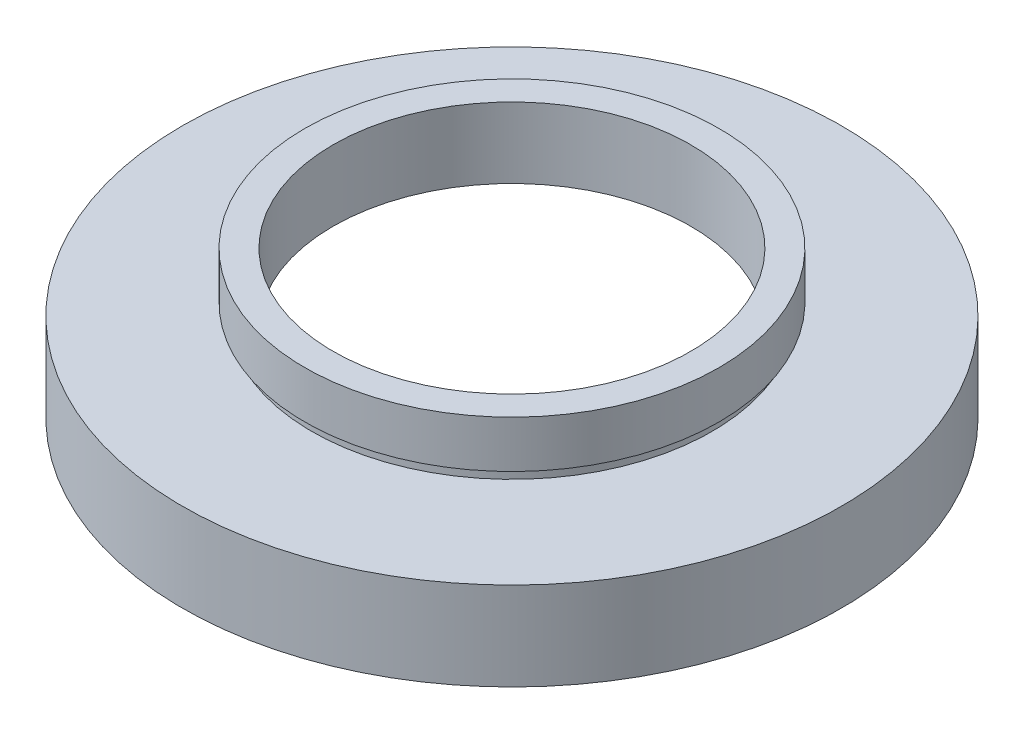
ISO-10303-21;
HEADER;
FILE_DESCRIPTION(('STEP AP214'),'2;1');
FILE_NAME('part.step','',(''),(''),'','','');
FILE_SCHEMA(('AUTOMOTIVE_DESIGN { 1 0 10303 214 1 1 1 1 }'));
ENDSEC;
DATA;
#1=APPLICATION_CONTEXT('core data for automotive mechanical design processes');
#2=APPLICATION_PROTOCOL_DEFINITION('international standard','automotive_design',2000,#1);
#3=PRODUCT_CONTEXT('',#1,'mechanical');
#4=PRODUCT('Part','Part','',(#3));
#5=PRODUCT_RELATED_PRODUCT_CATEGORY('part','',(#4));
#6=PRODUCT_DEFINITION_FORMATION('','',#4);
#7=PRODUCT_DEFINITION_CONTEXT('part definition',#1,'design');
#8=PRODUCT_DEFINITION('design','',#6,#7);
#9=PRODUCT_DEFINITION_SHAPE('','',#8);
#10=(LENGTH_UNIT() NAMED_UNIT(*) SI_UNIT(.MILLI.,.METRE.));
#11=(NAMED_UNIT(*) PLANE_ANGLE_UNIT() SI_UNIT($,.RADIAN.));
#12=(NAMED_UNIT(*) SI_UNIT($,.STERADIAN.) SOLID_ANGLE_UNIT());
#13=UNCERTAINTY_MEASURE_WITH_UNIT(LENGTH_MEASURE(1.E-05),#10,'distance_accuracy_value','');
#14=(GEOMETRIC_REPRESENTATION_CONTEXT(3) GLOBAL_UNCERTAINTY_ASSIGNED_CONTEXT((#13)) GLOBAL_UNIT_ASSIGNED_CONTEXT((#10,
#11,#12)) REPRESENTATION_CONTEXT('',''));
#15=CARTESIAN_POINT('',(0.,0.,0.));
#16=DIRECTION('',(0.,0.,1.));
#17=DIRECTION('',(1.,0.,0.));
#18=AXIS2_PLACEMENT_3D('',#15,#16,#17);
#19=CARTESIAN_POINT('',(28.,0.,0.));
#20=DIRECTION('',(0.,1.,0.));
#21=DIRECTION('',(-1.,0.,0.));
#22=AXIS2_PLACEMENT_3D('',#19,#20,#21);
#23=PLANE('',#22);
#24=CARTESIAN_POINT('',(0.,0.,0.));
#25=DIRECTION('',(0.,1.,0.));
#26=DIRECTION('',(-1.,0.,0.));
#27=AXIS2_PLACEMENT_3D('',#24,#25,#26);
#28=CIRCLE('',#27,28.);
#29=CARTESIAN_POINT('',(-28.,0.,0.));
#30=VERTEX_POINT('',#29);
#31=EDGE_CURVE('E75',#30,#30,#28,.T.);
#32=ORIENTED_EDGE('',*,*,#31,.F.);
#33=EDGE_LOOP('',(#32));
#34=FACE_BOUND('',#33,.T.);
#35=CARTESIAN_POINT('',(0.,0.,0.));
#36=DIRECTION('',(0.,1.,0.));
#37=DIRECTION('',(-1.,0.,0.));
#38=AXIS2_PLACEMENT_3D('',#35,#36,#37);
#39=CIRCLE('',#38,25.3);
#40=CARTESIAN_POINT('',(-25.3,0.,0.));
#41=VERTEX_POINT('',#40);
#42=EDGE_CURVE('E10',#41,#41,#39,.T.);
#43=ORIENTED_EDGE('',*,*,#42,.T.);
#44=EDGE_LOOP('',(#43));
#45=FACE_BOUND('',#44,.T.);
#46=ADVANCED_FACE('F35',(#34,#45),#23,.F.);
#47=CARTESIAN_POINT('',(0.,16.8860182370821,0.));
#48=DIRECTION('',(0.,1.,0.));
#49=DIRECTION('',(-1.,0.,0.));
#50=AXIS2_PLACEMENT_3D('',#47,#48,#49);
#51=CYLINDRICAL_SURFACE('',#50,25.3);
#52=ORIENTED_EDGE('',*,*,#42,.F.);
#53=EDGE_LOOP('',(#52));
#54=FACE_BOUND('',#53,.T.);
#55=CARTESIAN_POINT('',(0.,5.49999999999999,0.));
#56=DIRECTION('',(0.,1.,0.));
#57=DIRECTION('',(-1.,0.,0.));
#58=AXIS2_PLACEMENT_3D('',#55,#56,#57);
#59=CIRCLE('',#58,25.3);
#60=CARTESIAN_POINT('',(-25.3,5.49999999999999,0.));
#61=VERTEX_POINT('',#60);
#62=EDGE_CURVE('E41',#61,#61,#59,.T.);
#63=ORIENTED_EDGE('',*,*,#62,.T.);
#64=EDGE_LOOP('',(#63));
#65=FACE_BOUND('',#64,.T.);
#66=ADVANCED_FACE('F82',(#54,#65),#51,.F.);
#67=CARTESIAN_POINT('',(25.3,5.5,0.));
#68=DIRECTION('',(0.,-1.,0.));
#69=DIRECTION('',(1.,0.,0.));
#70=AXIS2_PLACEMENT_3D('',#67,#68,#69);
#71=PLANE('',#70);
#72=ORIENTED_EDGE('',*,*,#62,.F.);
#73=EDGE_LOOP('',(#72));
#74=FACE_BOUND('',#73,.T.);
#75=CARTESIAN_POINT('',(0.,5.49999999999999,0.));
#76=DIRECTION('',(0.,1.,0.));
#77=DIRECTION('',(-1.,0.,0.));
#78=AXIS2_PLACEMENT_3D('',#75,#76,#77);
#79=CIRCLE('',#78,25.95);
#80=CARTESIAN_POINT('',(-25.95,5.49999999999999,0.));
#81=VERTEX_POINT('',#80);
#82=EDGE_CURVE('E45',#81,#81,#79,.T.);
#83=ORIENTED_EDGE('',*,*,#82,.T.);
#84=EDGE_LOOP('',(#83));
#85=FACE_BOUND('',#84,.T.);
#86=ADVANCED_FACE('F86',(#74,#85),#71,.F.);
#87=CARTESIAN_POINT('',(0.,16.8860182370821,0.));
#88=DIRECTION('',(0.,1.,0.));
#89=DIRECTION('',(-1.,0.,0.));
#90=AXIS2_PLACEMENT_3D('',#87,#88,#89);
#91=CYLINDRICAL_SURFACE('',#90,25.95);
#92=ORIENTED_EDGE('',*,*,#82,.F.);
#93=EDGE_LOOP('',(#92));
#94=FACE_BOUND('',#93,.T.);
#95=CARTESIAN_POINT('',(0.,6.5,0.));
#96=DIRECTION('',(0.,1.,0.));
#97=DIRECTION('',(-1.,0.,0.));
#98=AXIS2_PLACEMENT_3D('',#95,#96,#97);
#99=CIRCLE('',#98,25.95);
#100=CARTESIAN_POINT('',(-25.95,6.49999999999999,0.));
#101=VERTEX_POINT('',#100);
#102=EDGE_CURVE('E49',#101,#101,#99,.T.);
#103=ORIENTED_EDGE('',*,*,#102,.T.);
#104=EDGE_LOOP('',(#103));
#105=FACE_BOUND('',#104,.T.);
#106=ADVANCED_FACE('F91',(#94,#105),#91,.F.);
#107=CARTESIAN_POINT('',(15.2,6.5,0.));
#108=DIRECTION('',(0.,1.,0.));
#109=DIRECTION('',(-1.,0.,0.));
#110=AXIS2_PLACEMENT_3D('',#107,#108,#109);
#111=PLANE('',#110);
#112=ORIENTED_EDGE('',*,*,#102,.F.);
#113=EDGE_LOOP('',(#112));
#114=FACE_BOUND('',#113,.T.);
#115=CARTESIAN_POINT('',(0.,6.5,0.));
#116=DIRECTION('',(0.,1.,0.));
#117=DIRECTION('',(-1.,0.,0.));
#118=AXIS2_PLACEMENT_3D('',#115,#116,#117);
#119=CIRCLE('',#118,15.2);
#120=CARTESIAN_POINT('',(-15.2,6.5,0.));
#121=VERTEX_POINT('',#120);
#122=EDGE_CURVE('E54',#121,#121,#119,.T.);
#123=ORIENTED_EDGE('',*,*,#122,.T.);
#124=EDGE_LOOP('',(#123));
#125=FACE_BOUND('',#124,.T.);
#126=ADVANCED_FACE('F97',(#114,#125),#111,.F.);
#127=CARTESIAN_POINT('',(0.,16.8860182370821,0.));
#128=DIRECTION('',(0.,1.,0.));
#129=DIRECTION('',(-1.,0.,0.));
#130=AXIS2_PLACEMENT_3D('',#127,#128,#129);
#131=CYLINDRICAL_SURFACE('',#130,15.2);
#132=ORIENTED_EDGE('',*,*,#122,.F.);
#133=EDGE_LOOP('',(#132));
#134=FACE_BOUND('',#133,.T.);
#135=CARTESIAN_POINT('',(0.,12.5,0.));
#136=DIRECTION('',(0.,1.,0.));
#137=DIRECTION('',(-1.,0.,0.));
#138=AXIS2_PLACEMENT_3D('',#135,#136,#137);
#139=CIRCLE('',#138,15.2);
#140=CARTESIAN_POINT('',(-15.2,12.5,0.));
#141=VERTEX_POINT('',#140);
#142=EDGE_CURVE('E57',#141,#141,#139,.T.);
#143=ORIENTED_EDGE('',*,*,#142,.T.);
#144=EDGE_LOOP('',(#143));
#145=FACE_BOUND('',#144,.T.);
#146=ADVANCED_FACE('F101',(#134,#145),#131,.F.);
#147=CARTESIAN_POINT('',(15.2,12.5,0.));
#148=DIRECTION('',(0.,-1.,0.));
#149=DIRECTION('',(1.,0.,0.));
#150=AXIS2_PLACEMENT_3D('',#147,#148,#149);
#151=PLANE('',#150);
#152=ORIENTED_EDGE('',*,*,#142,.F.);
#153=EDGE_LOOP('',(#152));
#154=FACE_BOUND('',#153,.T.);
#155=CARTESIAN_POINT('',(0.,12.5,0.));
#156=DIRECTION('',(0.,1.,0.));
#157=DIRECTION('',(-1.,0.,0.));
#158=AXIS2_PLACEMENT_3D('',#155,#156,#157);
#159=CIRCLE('',#158,17.6);
#160=CARTESIAN_POINT('',(-17.6,12.5,0.));
#161=VERTEX_POINT('',#160);
#162=EDGE_CURVE('E60',#161,#161,#159,.T.);
#163=ORIENTED_EDGE('',*,*,#162,.T.);
#164=EDGE_LOOP('',(#163));
#165=FACE_BOUND('',#164,.T.);
#166=ADVANCED_FACE('F105',(#154,#165),#151,.F.);
#167=CARTESIAN_POINT('',(0.,16.8860182370821,0.));
#168=DIRECTION('',(0.,1.,0.));
#169=DIRECTION('',(-1.,0.,0.));
#170=AXIS2_PLACEMENT_3D('',#167,#168,#169);
#171=CYLINDRICAL_SURFACE('',#170,17.6);
#172=ORIENTED_EDGE('',*,*,#162,.F.);
#173=EDGE_LOOP('',(#172));
#174=FACE_BOUND('',#173,.T.);
#175=CARTESIAN_POINT('',(0.,8.5,0.));
#176=DIRECTION('',(0.,1.,0.));
#177=DIRECTION('',(-1.,0.,0.));
#178=AXIS2_PLACEMENT_3D('',#175,#176,#177);
#179=CIRCLE('',#178,17.6);
#180=CARTESIAN_POINT('',(-17.6,8.5,0.));
#181=VERTEX_POINT('',#180);
#182=EDGE_CURVE('E63',#181,#181,#179,.T.);
#183=ORIENTED_EDGE('',*,*,#182,.T.);
#184=EDGE_LOOP('',(#183));
#185=FACE_BOUND('',#184,.T.);
#186=ADVANCED_FACE('F109',(#174,#185),#171,.T.);
#187=CARTESIAN_POINT('',(17.6,8.5,0.));
#188=DIRECTION('',(0.,1.,0.));
#189=DIRECTION('',(-1.,0.,0.));
#190=AXIS2_PLACEMENT_3D('',#187,#188,#189);
#191=PLANE('',#190);
#192=ORIENTED_EDGE('',*,*,#182,.F.);
#193=EDGE_LOOP('',(#192));
#194=FACE_BOUND('',#193,.T.);
#195=CARTESIAN_POINT('',(0.,8.5,0.));
#196=DIRECTION('',(0.,1.,0.));
#197=DIRECTION('',(-1.,0.,0.));
#198=AXIS2_PLACEMENT_3D('',#195,#196,#197);
#199=CIRCLE('',#198,17.);
#200=CARTESIAN_POINT('',(-17.,8.5,0.));
#201=VERTEX_POINT('',#200);
#202=EDGE_CURVE('E66',#201,#201,#199,.T.);
#203=ORIENTED_EDGE('',*,*,#202,.T.);
#204=EDGE_LOOP('',(#203));
#205=FACE_BOUND('',#204,.T.);
#206=ADVANCED_FACE('F113',(#194,#205),#191,.F.);
#207=CARTESIAN_POINT('',(0.,16.8860182370821,0.));
#208=DIRECTION('',(0.,1.,0.));
#209=DIRECTION('',(-1.,0.,0.));
#210=AXIS2_PLACEMENT_3D('',#207,#208,#209);
#211=CYLINDRICAL_SURFACE('',#210,17.);
#212=ORIENTED_EDGE('',*,*,#202,.F.);
#213=EDGE_LOOP('',(#212));
#214=FACE_BOUND('',#213,.T.);
#215=CARTESIAN_POINT('',(0.,7.5,0.));
#216=DIRECTION('',(0.,1.,0.));
#217=DIRECTION('',(-1.,0.,0.));
#218=AXIS2_PLACEMENT_3D('',#215,#216,#217);
#219=CIRCLE('',#218,17.);
#220=CARTESIAN_POINT('',(-17.,7.5,0.));
#221=VERTEX_POINT('',#220);
#222=EDGE_CURVE('E69',#221,#221,#219,.T.);
#223=ORIENTED_EDGE('',*,*,#222,.T.);
#224=EDGE_LOOP('',(#223));
#225=FACE_BOUND('',#224,.T.);
#226=ADVANCED_FACE('F117',(#214,#225),#211,.T.);
#227=CARTESIAN_POINT('',(17.,7.5,0.));
#228=DIRECTION('',(0.,-1.,0.));
#229=DIRECTION('',(1.,0.,0.));
#230=AXIS2_PLACEMENT_3D('',#227,#228,#229);
#231=PLANE('',#230);
#232=ORIENTED_EDGE('',*,*,#222,.F.);
#233=EDGE_LOOP('',(#232));
#234=FACE_BOUND('',#233,.T.);
#235=CARTESIAN_POINT('',(0.,7.5,0.));
#236=DIRECTION('',(0.,1.,0.));
#237=DIRECTION('',(-1.,0.,0.));
#238=AXIS2_PLACEMENT_3D('',#235,#236,#237);
#239=CIRCLE('',#238,28.);
#240=CARTESIAN_POINT('',(-28.,7.49999999999999,0.));
#241=VERTEX_POINT('',#240);
#242=EDGE_CURVE('E72',#241,#241,#239,.T.);
#243=ORIENTED_EDGE('',*,*,#242,.T.);
#244=EDGE_LOOP('',(#243));
#245=FACE_BOUND('',#244,.T.);
#246=ADVANCED_FACE('F121',(#234,#245),#231,.F.);
#247=CARTESIAN_POINT('',(0.,16.8860182370821,0.));
#248=DIRECTION('',(0.,1.,0.));
#249=DIRECTION('',(-1.,0.,0.));
#250=AXIS2_PLACEMENT_3D('',#247,#248,#249);
#251=CYLINDRICAL_SURFACE('',#250,28.);
#252=ORIENTED_EDGE('',*,*,#242,.F.);
#253=EDGE_LOOP('',(#252));
#254=FACE_BOUND('',#253,.T.);
#255=ORIENTED_EDGE('',*,*,#31,.T.);
#256=EDGE_LOOP('',(#255));
#257=FACE_BOUND('',#256,.T.);
#258=ADVANCED_FACE('F79',(#254,#257),#251,.T.);
#259=CLOSED_SHELL('',(#46,#66,#86,#106,#126,#146,#166,#186,#206,#226,#246,#258));
#260=MANIFOLD_SOLID_BREP('B2',#259);
#261=ADVANCED_BREP_SHAPE_REPRESENTATION('',(#18,#260),#14);
#262=SHAPE_DEFINITION_REPRESENTATION(#9,#261);
ENDSEC;
END-ISO-10303-21;
